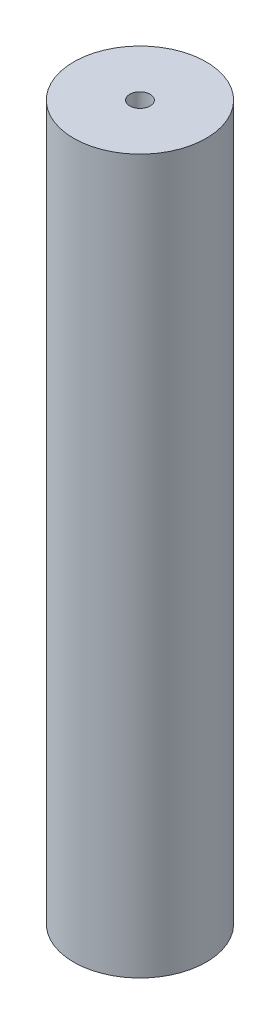
ISO-10303-21;
HEADER;
FILE_DESCRIPTION(('STEP AP214'),'2;1');
FILE_NAME('part.step','',(''),(''),'','','');
FILE_SCHEMA(('AUTOMOTIVE_DESIGN { 1 0 10303 214 1 1 1 1 }'));
ENDSEC;
DATA;
#1=APPLICATION_CONTEXT('core data for automotive mechanical design processes');
#2=APPLICATION_PROTOCOL_DEFINITION('international standard','automotive_design',2000,#1);
#3=PRODUCT_CONTEXT('',#1,'mechanical');
#4=PRODUCT('Part','Part','',(#3));
#5=PRODUCT_RELATED_PRODUCT_CATEGORY('part','',(#4));
#6=PRODUCT_DEFINITION_FORMATION('','',#4);
#7=PRODUCT_DEFINITION_CONTEXT('part definition',#1,'design');
#8=PRODUCT_DEFINITION('design','',#6,#7);
#9=PRODUCT_DEFINITION_SHAPE('','',#8);
#10=(LENGTH_UNIT() NAMED_UNIT(*) SI_UNIT(.MILLI.,.METRE.));
#11=(NAMED_UNIT(*) PLANE_ANGLE_UNIT() SI_UNIT($,.RADIAN.));
#12=(NAMED_UNIT(*) SI_UNIT($,.STERADIAN.) SOLID_ANGLE_UNIT());
#13=UNCERTAINTY_MEASURE_WITH_UNIT(LENGTH_MEASURE(1.E-05),#10,'distance_accuracy_value','');
#14=(GEOMETRIC_REPRESENTATION_CONTEXT(3) GLOBAL_UNCERTAINTY_ASSIGNED_CONTEXT((#13)) GLOBAL_UNIT_ASSIGNED_CONTEXT((#10,
#11,#12)) REPRESENTATION_CONTEXT('',''));
#15=CARTESIAN_POINT('',(0.,0.,0.));
#16=DIRECTION('',(0.,0.,1.));
#17=DIRECTION('',(1.,0.,0.));
#18=AXIS2_PLACEMENT_3D('',#15,#16,#17);
#19=CARTESIAN_POINT('',(0.,70.,0.));
#20=DIRECTION('',(0.,-1.,0.));
#21=DIRECTION('',(0.,0.,-1.));
#22=AXIS2_PLACEMENT_3D('',#19,#20,#21);
#23=CYLINDRICAL_SURFACE('',#22,6.5);
#24=CARTESIAN_POINT('',(0.,70.,0.));
#25=DIRECTION('',(0.,1.,0.));
#26=DIRECTION('',(0.,0.,1.));
#27=AXIS2_PLACEMENT_3D('',#24,#25,#26);
#28=CIRCLE('',#27,6.5);
#29=CARTESIAN_POINT('',(0.,70.,6.5));
#30=VERTEX_POINT('',#29);
#31=EDGE_CURVE('E10',#30,#30,#28,.T.);
#32=ORIENTED_EDGE('',*,*,#31,.F.);
#33=EDGE_LOOP('',(#32));
#34=FACE_BOUND('',#33,.T.);
#35=CARTESIAN_POINT('',(0.,0.,0.));
#36=DIRECTION('',(0.,1.,0.));
#37=DIRECTION('',(0.,0.,1.));
#38=AXIS2_PLACEMENT_3D('',#35,#36,#37);
#39=CIRCLE('',#38,6.5);
#40=CARTESIAN_POINT('',(0.,0.,6.5));
#41=VERTEX_POINT('',#40);
#42=EDGE_CURVE('E37',#41,#41,#39,.T.);
#43=ORIENTED_EDGE('',*,*,#42,.T.);
#44=EDGE_LOOP('',(#43));
#45=FACE_BOUND('',#44,.T.);
#46=ADVANCED_FACE('F34',(#34,#45),#23,.T.);
#47=CARTESIAN_POINT('',(0.,70.,0.));
#48=DIRECTION('',(0.,1.,0.));
#49=DIRECTION('',(0.,0.,1.));
#50=AXIS2_PLACEMENT_3D('',#47,#48,#49);
#51=PLANE('',#50);
#52=CARTESIAN_POINT('',(0.,70.,0.));
#53=DIRECTION('',(0.,1.,0.));
#54=DIRECTION('',(0.,0.,1.));
#55=AXIS2_PLACEMENT_3D('',#52,#53,#54);
#56=CIRCLE('',#55,1.);
#57=CARTESIAN_POINT('',(0.,70.,1.));
#58=VERTEX_POINT('',#57);
#59=EDGE_CURVE('E46',#58,#58,#56,.T.);
#60=ORIENTED_EDGE('',*,*,#59,.F.);
#61=EDGE_LOOP('',(#60));
#62=FACE_BOUND('',#61,.T.);
#63=ORIENTED_EDGE('',*,*,#31,.T.);
#64=EDGE_LOOP('',(#63));
#65=FACE_BOUND('',#64,.T.);
#66=ADVANCED_FACE('F61',(#62,#65),#51,.T.);
#67=CARTESIAN_POINT('',(0.,0.,0.));
#68=DIRECTION('',(0.,1.,0.));
#69=DIRECTION('',(0.,0.,1.));
#70=AXIS2_PLACEMENT_3D('',#67,#68,#69);
#71=PLANE('',#70);
#72=CARTESIAN_POINT('',(0.,0.,0.));
#73=DIRECTION('',(0.,1.,0.));
#74=DIRECTION('',(0.,0.,1.));
#75=AXIS2_PLACEMENT_3D('',#72,#73,#74);
#76=CIRCLE('',#75,1.);
#77=CARTESIAN_POINT('',(0.,0.,1.));
#78=VERTEX_POINT('',#77);
#79=EDGE_CURVE('E44',#78,#78,#76,.T.);
#80=ORIENTED_EDGE('',*,*,#79,.T.);
#81=EDGE_LOOP('',(#80));
#82=FACE_BOUND('',#81,.T.);
#83=ORIENTED_EDGE('',*,*,#42,.F.);
#84=EDGE_LOOP('',(#83));
#85=FACE_BOUND('',#84,.T.);
#86=ADVANCED_FACE('F52',(#82,#85),#71,.F.);
#87=CARTESIAN_POINT('',(0.,0.,0.));
#88=DIRECTION('',(0.,1.,0.));
#89=DIRECTION('',(0.,0.,1.));
#90=AXIS2_PLACEMENT_3D('',#87,#88,#89);
#91=CYLINDRICAL_SURFACE('',#90,1.);
#92=ORIENTED_EDGE('',*,*,#79,.F.);
#93=EDGE_LOOP('',(#92));
#94=FACE_BOUND('',#93,.T.);
#95=ORIENTED_EDGE('',*,*,#59,.T.);
#96=EDGE_LOOP('',(#95));
#97=FACE_BOUND('',#96,.T.);
#98=ADVANCED_FACE('F55',(#94,#97),#91,.F.);
#99=CLOSED_SHELL('',(#46,#66,#86,#98));
#100=MANIFOLD_SOLID_BREP('B2',#99);
#101=ADVANCED_BREP_SHAPE_REPRESENTATION('',(#18,#100),#14);
#102=SHAPE_DEFINITION_REPRESENTATION(#9,#101);
ENDSEC;
END-ISO-10303-21;
